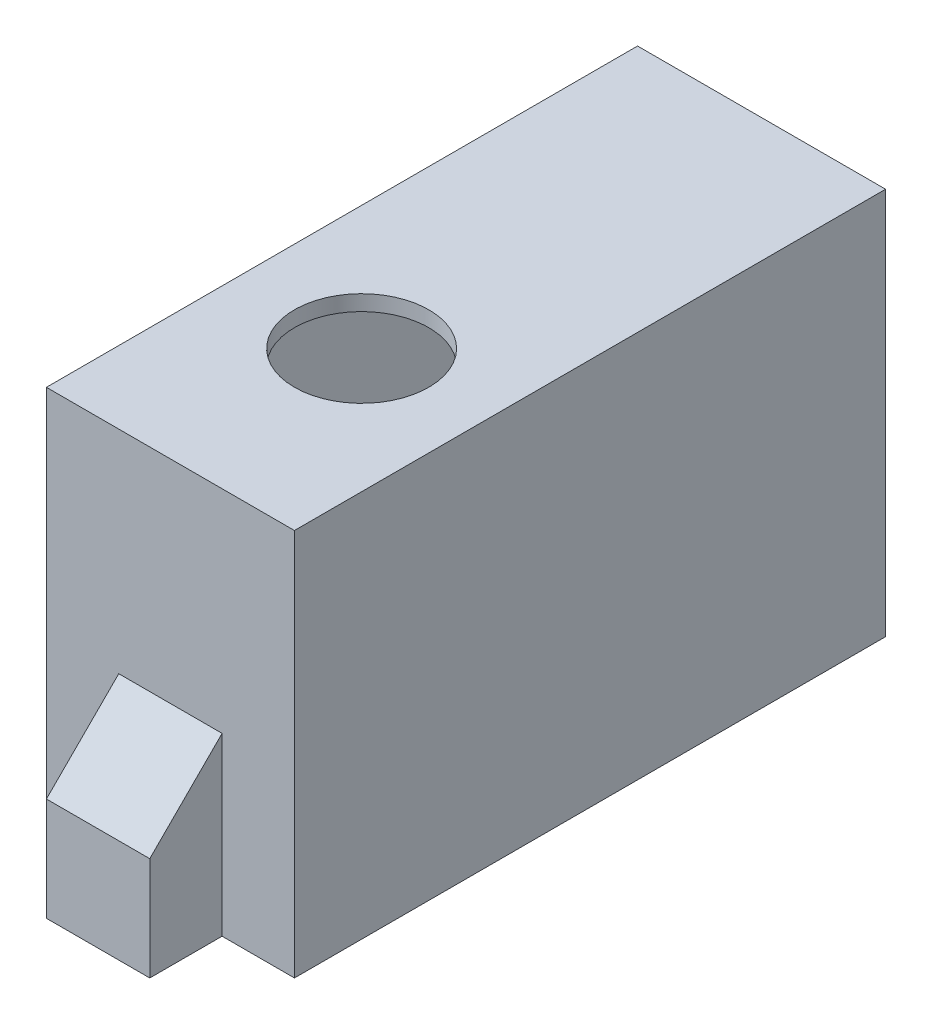
ISO-10303-21;
HEADER;
FILE_DESCRIPTION(('STEP AP214'),'2;1');
FILE_NAME('part.step','',(''),(''),'','','');
FILE_SCHEMA(('AUTOMOTIVE_DESIGN { 1 0 10303 214 1 1 1 1 }'));
ENDSEC;
DATA;
#1=APPLICATION_CONTEXT('core data for automotive mechanical design processes');
#2=APPLICATION_PROTOCOL_DEFINITION('international standard','automotive_design',2000,#1);
#3=PRODUCT_CONTEXT('',#1,'mechanical');
#4=PRODUCT('Part','Part','',(#3));
#5=PRODUCT_RELATED_PRODUCT_CATEGORY('part','',(#4));
#6=PRODUCT_DEFINITION_FORMATION('','',#4);
#7=PRODUCT_DEFINITION_CONTEXT('part definition',#1,'design');
#8=PRODUCT_DEFINITION('design','',#6,#7);
#9=PRODUCT_DEFINITION_SHAPE('','',#8);
#10=(LENGTH_UNIT() NAMED_UNIT(*) SI_UNIT(.MILLI.,.METRE.));
#11=(NAMED_UNIT(*) PLANE_ANGLE_UNIT() SI_UNIT($,.RADIAN.));
#12=(NAMED_UNIT(*) SI_UNIT($,.STERADIAN.) SOLID_ANGLE_UNIT());
#13=UNCERTAINTY_MEASURE_WITH_UNIT(LENGTH_MEASURE(1.E-05),#10,'distance_accuracy_value','');
#14=(GEOMETRIC_REPRESENTATION_CONTEXT(3) GLOBAL_UNCERTAINTY_ASSIGNED_CONTEXT((#13)) GLOBAL_UNIT_ASSIGNED_CONTEXT((#10,
#11,#12)) REPRESENTATION_CONTEXT('',''));
#15=CARTESIAN_POINT('',(0.,0.,0.));
#16=DIRECTION('',(0.,0.,1.));
#17=DIRECTION('',(1.,0.,0.));
#18=AXIS2_PLACEMENT_3D('',#15,#16,#17);
#19=CARTESIAN_POINT('',(-10.,36.,28.6));
#20=DIRECTION('',(0.,0.,-1.));
#21=DIRECTION('',(-1.,0.,0.));
#22=AXIS2_PLACEMENT_3D('',#19,#20,#21);
#23=PLANE('',#22);
#24=DIRECTION('',(1.,0.,0.));
#25=VECTOR('',#24,1.);
#26=CARTESIAN_POINT('',(-10.,37.5,28.6));
#27=LINE('',#26,#25);
#28=CARTESIAN_POINT('',(-12.,37.5,28.6));
#29=VERTEX_POINT('',#28);
#30=CARTESIAN_POINT('',(12.,37.5,28.6));
#31=VERTEX_POINT('',#30);
#32=EDGE_CURVE('E49',#29,#31,#27,.T.);
#33=ORIENTED_EDGE('',*,*,#32,.F.);
#34=DIRECTION('',(0.,-1.,0.));
#35=VECTOR('',#34,1.);
#36=CARTESIAN_POINT('',(-12.,36.,28.6));
#37=LINE('',#36,#35);
#38=CARTESIAN_POINT('',(-12.,0.,28.6));
#39=VERTEX_POINT('',#38);
#40=EDGE_CURVE('E167',#29,#39,#37,.T.);
#41=ORIENTED_EDGE('',*,*,#40,.T.);
#42=DIRECTION('',(1.,0.,0.));
#43=VECTOR('',#42,1.);
#44=CARTESIAN_POINT('',(-10.,0.,28.6));
#45=LINE('',#44,#43);
#46=CARTESIAN_POINT('',(-5.,0.,28.6));
#47=VERTEX_POINT('',#46);
#48=EDGE_CURVE('E195',#39,#47,#45,.T.);
#49=ORIENTED_EDGE('',*,*,#48,.T.);
#50=DIRECTION('',(0.,-1.,0.));
#51=VECTOR('',#50,1.);
#52=CARTESIAN_POINT('',(-5.,0.,28.6));
#53=LINE('',#52,#51);
#54=CARTESIAN_POINT('',(-5.,17.,28.6));
#55=VERTEX_POINT('',#54);
#56=EDGE_CURVE('E57',#55,#47,#53,.T.);
#57=ORIENTED_EDGE('',*,*,#56,.F.);
#58=DIRECTION('',(1.,0.,0.));
#59=VECTOR('',#58,1.);
#60=CARTESIAN_POINT('',(5.,17.,28.6));
#61=LINE('',#60,#59);
#62=CARTESIAN_POINT('',(5.,17.,28.6));
#63=VERTEX_POINT('',#62);
#64=EDGE_CURVE('E243',#55,#63,#61,.T.);
#65=ORIENTED_EDGE('',*,*,#64,.T.);
#66=DIRECTION('',(0.,1.,0.));
#67=VECTOR('',#66,1.);
#68=CARTESIAN_POINT('',(5.,0.,28.6));
#69=LINE('',#68,#67);
#70=CARTESIAN_POINT('',(5.,0.,28.6));
#71=VERTEX_POINT('',#70);
#72=EDGE_CURVE('E269',#71,#63,#69,.T.);
#73=ORIENTED_EDGE('',*,*,#72,.F.);
#74=CARTESIAN_POINT('',(12.,0.,28.6));
#75=VERTEX_POINT('',#74);
#76=EDGE_CURVE('E175',#71,#75,#45,.T.);
#77=ORIENTED_EDGE('',*,*,#76,.T.);
#78=DIRECTION('',(0.,-1.,0.));
#79=VECTOR('',#78,1.);
#80=CARTESIAN_POINT('',(12.,36.,28.6));
#81=LINE('',#80,#79);
#82=EDGE_CURVE('E165',#31,#75,#81,.T.);
#83=ORIENTED_EDGE('',*,*,#82,.F.);
#84=EDGE_LOOP('',(#33,#41,#49,#57,#65,#73,#77,#83));
#85=FACE_BOUND('',#84,.T.);
#86=ADVANCED_FACE('F33',(#85),#23,.F.);
#87=CARTESIAN_POINT('',(-10.,36.,-28.6));
#88=DIRECTION('',(0.,0.,1.));
#89=DIRECTION('',(1.,0.,0.));
#90=AXIS2_PLACEMENT_3D('',#87,#88,#89);
#91=PLANE('',#90);
#92=DIRECTION('',(-1.,0.,0.));
#93=VECTOR('',#92,1.);
#94=CARTESIAN_POINT('',(-10.,37.5,-28.6));
#95=LINE('',#94,#93);
#96=CARTESIAN_POINT('',(12.,37.5,-28.6));
#97=VERTEX_POINT('',#96);
#98=CARTESIAN_POINT('',(-12.,37.5,-28.6));
#99=VERTEX_POINT('',#98);
#100=EDGE_CURVE('E147',#97,#99,#95,.T.);
#101=ORIENTED_EDGE('',*,*,#100,.F.);
#102=DIRECTION('',(0.,-1.,0.));
#103=VECTOR('',#102,1.);
#104=CARTESIAN_POINT('',(12.,36.,-28.6));
#105=LINE('',#104,#103);
#106=CARTESIAN_POINT('',(12.,0.,-28.6));
#107=VERTEX_POINT('',#106);
#108=EDGE_CURVE('E156',#97,#107,#105,.T.);
#109=ORIENTED_EDGE('',*,*,#108,.T.);
#110=DIRECTION('',(-1.,0.,0.));
#111=VECTOR('',#110,1.);
#112=CARTESIAN_POINT('',(-10.,0.,-28.6));
#113=LINE('',#112,#111);
#114=CARTESIAN_POINT('',(4.99999999999999,0.,-28.6));
#115=VERTEX_POINT('',#114);
#116=EDGE_CURVE('E169',#107,#115,#113,.T.);
#117=ORIENTED_EDGE('',*,*,#116,.T.);
#118=DIRECTION('',(0.,-1.,0.));
#119=VECTOR('',#118,1.);
#120=CARTESIAN_POINT('',(4.99999999999999,10.,-28.6));
#121=LINE('',#120,#119);
#122=CARTESIAN_POINT('',(5.,17.,-28.6));
#123=VERTEX_POINT('',#122);
#124=EDGE_CURVE('E197',#123,#115,#121,.T.);
#125=ORIENTED_EDGE('',*,*,#124,.F.);
#126=DIRECTION('',(-1.,0.,0.));
#127=VECTOR('',#126,1.);
#128=CARTESIAN_POINT('',(-5.00000000000001,17.,-28.6));
#129=LINE('',#128,#127);
#130=CARTESIAN_POINT('',(-5.00000000000001,17.,-28.6));
#131=VERTEX_POINT('',#130);
#132=EDGE_CURVE('E239',#123,#131,#129,.T.);
#133=ORIENTED_EDGE('',*,*,#132,.T.);
#134=DIRECTION('',(0.,1.,0.));
#135=VECTOR('',#134,1.);
#136=CARTESIAN_POINT('',(-5.00000000000001,10.,-28.6));
#137=LINE('',#136,#135);
#138=CARTESIAN_POINT('',(-5.00000000000001,0.,-28.6));
#139=VERTEX_POINT('',#138);
#140=EDGE_CURVE('E201',#139,#131,#137,.T.);
#141=ORIENTED_EDGE('',*,*,#140,.F.);
#142=CARTESIAN_POINT('',(-12.,0.,-28.6));
#143=VERTEX_POINT('',#142);
#144=EDGE_CURVE('E182',#139,#143,#113,.T.);
#145=ORIENTED_EDGE('',*,*,#144,.T.);
#146=DIRECTION('',(0.,-1.,0.));
#147=VECTOR('',#146,1.);
#148=CARTESIAN_POINT('',(-12.,36.,-28.6));
#149=LINE('',#148,#147);
#150=EDGE_CURVE('E159',#99,#143,#149,.T.);
#151=ORIENTED_EDGE('',*,*,#150,.F.);
#152=EDGE_LOOP('',(#101,#109,#117,#125,#133,#141,#145,#151));
#153=FACE_BOUND('',#152,.T.);
#154=ADVANCED_FACE('F155',(#153),#91,.F.);
#155=CARTESIAN_POINT('',(-12.,36.,-26.6));
#156=DIRECTION('',(1.,0.,0.));
#157=DIRECTION('',(0.,0.,-1.));
#158=AXIS2_PLACEMENT_3D('',#155,#156,#157);
#159=PLANE('',#158);
#160=DIRECTION('',(0.,0.,1.));
#161=VECTOR('',#160,1.);
#162=CARTESIAN_POINT('',(-12.,37.5,-26.6));
#163=LINE('',#162,#161);
#164=EDGE_CURVE('E323',#99,#29,#163,.T.);
#165=ORIENTED_EDGE('',*,*,#164,.F.);
#166=ORIENTED_EDGE('',*,*,#150,.T.);
#167=DIRECTION('',(0.,0.,1.));
#168=VECTOR('',#167,1.);
#169=CARTESIAN_POINT('',(-12.,0.,-26.6));
#170=LINE('',#169,#168);
#171=EDGE_CURVE('E172',#143,#39,#170,.T.);
#172=ORIENTED_EDGE('',*,*,#171,.T.);
#173=ORIENTED_EDGE('',*,*,#40,.F.);
#174=EDGE_LOOP('',(#165,#166,#172,#173));
#175=FACE_BOUND('',#174,.T.);
#176=ADVANCED_FACE('F322',(#175),#159,.F.);
#177=CARTESIAN_POINT('',(12.,36.,-26.6));
#178=DIRECTION('',(-1.,0.,0.));
#179=DIRECTION('',(0.,0.,1.));
#180=AXIS2_PLACEMENT_3D('',#177,#178,#179);
#181=PLANE('',#180);
#182=DIRECTION('',(0.,0.,-1.));
#183=VECTOR('',#182,1.);
#184=CARTESIAN_POINT('',(12.,37.5,-26.6));
#185=LINE('',#184,#183);
#186=EDGE_CURVE('E144',#31,#97,#185,.T.);
#187=ORIENTED_EDGE('',*,*,#186,.F.);
#188=ORIENTED_EDGE('',*,*,#82,.T.);
#189=DIRECTION('',(0.,0.,-1.));
#190=VECTOR('',#189,1.);
#191=CARTESIAN_POINT('',(12.,0.,-26.6));
#192=LINE('',#191,#190);
#193=EDGE_CURVE('E163',#75,#107,#192,.T.);
#194=ORIENTED_EDGE('',*,*,#193,.T.);
#195=ORIENTED_EDGE('',*,*,#108,.F.);
#196=EDGE_LOOP('',(#187,#188,#194,#195));
#197=FACE_BOUND('',#196,.T.);
#198=ADVANCED_FACE('F161',(#197),#181,.F.);
#199=CARTESIAN_POINT('',(0.,33.,10.1));
#200=DIRECTION('',(0.,1.,0.));
#201=DIRECTION('',(0.,0.,1.));
#202=AXIS2_PLACEMENT_3D('',#199,#200,#201);
#203=CYLINDRICAL_SURFACE('',#202,6.5);
#204=CARTESIAN_POINT('',(0.,36.,10.1));
#205=DIRECTION('',(0.,1.,0.));
#206=DIRECTION('',(0.,0.,1.));
#207=AXIS2_PLACEMENT_3D('',#204,#205,#206);
#208=CIRCLE('',#207,6.5);
#209=CARTESIAN_POINT('',(0.,36.,16.6));
#210=VERTEX_POINT('',#209);
#211=EDGE_CURVE('E186',#210,#210,#208,.T.);
#212=ORIENTED_EDGE('',*,*,#211,.F.);
#213=EDGE_LOOP('',(#212));
#214=FACE_BOUND('',#213,.T.);
#215=CARTESIAN_POINT('',(0.,37.5,10.1));
#216=DIRECTION('',(0.,1.,0.));
#217=DIRECTION('',(0.,0.,1.));
#218=AXIS2_PLACEMENT_3D('',#215,#216,#217);
#219=CIRCLE('',#218,6.5);
#220=CARTESIAN_POINT('',(0.,37.5,16.6));
#221=VERTEX_POINT('',#220);
#222=EDGE_CURVE('E37',#221,#221,#219,.F.);
#223=ORIENTED_EDGE('',*,*,#222,.F.);
#224=EDGE_LOOP('',(#223));
#225=FACE_BOUND('',#224,.T.);
#226=ADVANCED_FACE('F363',(#214,#225),#203,.F.);
#227=CARTESIAN_POINT('',(0.,0.,0.));
#228=DIRECTION('',(0.,1.,0.));
#229=DIRECTION('',(0.,0.,1.));
#230=AXIS2_PLACEMENT_3D('',#227,#228,#229);
#231=PLANE('',#230);
#232=CARTESIAN_POINT('',(0.,0.,-31.6));
#233=DIRECTION('',(0.,-1.,0.));
#234=DIRECTION('',(0.,0.,-1.));
#235=AXIS2_PLACEMENT_3D('',#232,#233,#234);
#236=CIRCLE('',#235,1.75);
#237=CARTESIAN_POINT('',(0.,0.,-33.35));
#238=VERTEX_POINT('',#237);
#239=EDGE_CURVE('E324',#238,#238,#236,.T.);
#240=ORIENTED_EDGE('',*,*,#239,.F.);
#241=EDGE_LOOP('',(#240));
#242=FACE_BOUND('',#241,.T.);
#243=CARTESIAN_POINT('',(0.,0.,31.6));
#244=DIRECTION('',(0.,-1.,0.));
#245=DIRECTION('',(0.,0.,-1.));
#246=AXIS2_PLACEMENT_3D('',#243,#244,#245);
#247=CIRCLE('',#246,1.75);
#248=CARTESIAN_POINT('',(0.,0.,29.85));
#249=VERTEX_POINT('',#248);
#250=EDGE_CURVE('E332',#249,#249,#247,.T.);
#251=ORIENTED_EDGE('',*,*,#250,.F.);
#252=EDGE_LOOP('',(#251));
#253=FACE_BOUND('',#252,.T.);
#254=DIRECTION('',(-1.,0.,0.));
#255=VECTOR('',#254,1.);
#256=CARTESIAN_POINT('',(-10.,0.,-26.6));
#257=LINE('',#256,#255);
#258=CARTESIAN_POINT('',(9.99999999999999,0.,-26.6));
#259=VERTEX_POINT('',#258);
#260=CARTESIAN_POINT('',(-10.,0.,-26.6));
#261=VERTEX_POINT('',#260);
#262=EDGE_CURVE('E214',#259,#261,#257,.T.);
#263=ORIENTED_EDGE('',*,*,#262,.T.);
#264=DIRECTION('',(0.,0.,1.));
#265=VECTOR('',#264,1.);
#266=CARTESIAN_POINT('',(-10.,0.,-26.6));
#267=LINE('',#266,#265);
#268=CARTESIAN_POINT('',(-10.,0.,26.6));
#269=VERTEX_POINT('',#268);
#270=EDGE_CURVE('E188',#261,#269,#267,.T.);
#271=ORIENTED_EDGE('',*,*,#270,.T.);
#272=DIRECTION('',(1.,0.,0.));
#273=VECTOR('',#272,1.);
#274=CARTESIAN_POINT('',(-10.,0.,26.6));
#275=LINE('',#274,#273);
#276=CARTESIAN_POINT('',(10.,0.,26.6));
#277=VERTEX_POINT('',#276);
#278=EDGE_CURVE('E223',#269,#277,#275,.T.);
#279=ORIENTED_EDGE('',*,*,#278,.T.);
#280=DIRECTION('',(0.,0.,-1.));
#281=VECTOR('',#280,1.);
#282=CARTESIAN_POINT('',(9.99999999999999,0.,-26.6));
#283=LINE('',#282,#281);
#284=EDGE_CURVE('E226',#277,#259,#283,.T.);
#285=ORIENTED_EDGE('',*,*,#284,.T.);
#286=EDGE_LOOP('',(#263,#271,#279,#285));
#287=FACE_BOUND('',#286,.T.);
#288=ORIENTED_EDGE('',*,*,#171,.F.);
#289=ORIENTED_EDGE('',*,*,#144,.F.);
#290=DIRECTION('',(0.,0.,1.));
#291=VECTOR('',#290,1.);
#292=CARTESIAN_POINT('',(-5.00000000000001,0.,-35.6));
#293=LINE('',#292,#291);
#294=CARTESIAN_POINT('',(-5.00000000000001,0.,-35.6));
#295=VERTEX_POINT('',#294);
#296=EDGE_CURVE('E308',#295,#139,#293,.T.);
#297=ORIENTED_EDGE('',*,*,#296,.F.);
#298=DIRECTION('',(-1.,0.,0.));
#299=VECTOR('',#298,1.);
#300=CARTESIAN_POINT('',(4.99999999999999,0.,-35.6));
#301=LINE('',#300,#299);
#302=CARTESIAN_POINT('',(4.99999999999999,0.,-35.6));
#303=VERTEX_POINT('',#302);
#304=EDGE_CURVE('E301',#303,#295,#301,.T.);
#305=ORIENTED_EDGE('',*,*,#304,.F.);
#306=DIRECTION('',(0.,0.,1.));
#307=VECTOR('',#306,1.);
#308=CARTESIAN_POINT('',(4.99999999999999,0.,-35.6));
#309=LINE('',#308,#307);
#310=EDGE_CURVE('E189',#303,#115,#309,.T.);
#311=ORIENTED_EDGE('',*,*,#310,.T.);
#312=ORIENTED_EDGE('',*,*,#116,.F.);
#313=ORIENTED_EDGE('',*,*,#193,.F.);
#314=ORIENTED_EDGE('',*,*,#76,.F.);
#315=DIRECTION('',(0.,0.,-1.));
#316=VECTOR('',#315,1.);
#317=CARTESIAN_POINT('',(5.,0.,35.6));
#318=LINE('',#317,#316);
#319=CARTESIAN_POINT('',(5.,0.,35.6));
#320=VERTEX_POINT('',#319);
#321=EDGE_CURVE('E277',#320,#71,#318,.T.);
#322=ORIENTED_EDGE('',*,*,#321,.F.);
#323=DIRECTION('',(1.,0.,0.));
#324=VECTOR('',#323,1.);
#325=CARTESIAN_POINT('',(-5.,0.,35.6));
#326=LINE('',#325,#324);
#327=CARTESIAN_POINT('',(-5.,0.,35.6));
#328=VERTEX_POINT('',#327);
#329=EDGE_CURVE('E293',#328,#320,#326,.T.);
#330=ORIENTED_EDGE('',*,*,#329,.F.);
#331=DIRECTION('',(0.,0.,-1.));
#332=VECTOR('',#331,1.);
#333=CARTESIAN_POINT('',(-5.,0.,35.6));
#334=LINE('',#333,#332);
#335=EDGE_CURVE('E202',#328,#47,#334,.T.);
#336=ORIENTED_EDGE('',*,*,#335,.T.);
#337=ORIENTED_EDGE('',*,*,#48,.F.);
#338=EDGE_LOOP('',(#288,#289,#297,#305,#311,#312,#313,#314,#322,#330,#336,#337));
#339=FACE_BOUND('',#338,.T.);
#340=ADVANCED_FACE('F276',(#242,#253,#287,#339),#231,.F.);
#341=CARTESIAN_POINT('',(-10.,36.,-26.6));
#342=DIRECTION('',(1.,0.,0.));
#343=DIRECTION('',(0.,0.,-1.));
#344=AXIS2_PLACEMENT_3D('',#341,#342,#343);
#345=PLANE('',#344);
#346=ORIENTED_EDGE('',*,*,#270,.F.);
#347=DIRECTION('',(0.,-1.,0.));
#348=VECTOR('',#347,1.);
#349=CARTESIAN_POINT('',(-10.,36.,-26.6));
#350=LINE('',#349,#348);
#351=CARTESIAN_POINT('',(-10.,36.,-26.6));
#352=VERTEX_POINT('',#351);
#353=EDGE_CURVE('E220',#352,#261,#350,.T.);
#354=ORIENTED_EDGE('',*,*,#353,.F.);
#355=DIRECTION('',(0.,0.,1.));
#356=VECTOR('',#355,1.);
#357=CARTESIAN_POINT('',(-10.,36.,-26.6));
#358=LINE('',#357,#356);
#359=CARTESIAN_POINT('',(-10.,36.,26.6));
#360=VERTEX_POINT('',#359);
#361=EDGE_CURVE('E210',#352,#360,#358,.T.);
#362=ORIENTED_EDGE('',*,*,#361,.T.);
#363=DIRECTION('',(0.,-1.,0.));
#364=VECTOR('',#363,1.);
#365=CARTESIAN_POINT('',(-10.,36.,26.6));
#366=LINE('',#365,#364);
#367=EDGE_CURVE('E176',#360,#269,#366,.T.);
#368=ORIENTED_EDGE('',*,*,#367,.T.);
#369=EDGE_LOOP('',(#346,#354,#362,#368));
#370=FACE_BOUND('',#369,.T.);
#371=ADVANCED_FACE('F407',(#370),#345,.T.);
#372=CARTESIAN_POINT('',(-10.,36.,26.6));
#373=DIRECTION('',(0.,0.,-1.));
#374=DIRECTION('',(-1.,0.,0.));
#375=AXIS2_PLACEMENT_3D('',#372,#373,#374);
#376=PLANE('',#375);
#377=ORIENTED_EDGE('',*,*,#278,.F.);
#378=ORIENTED_EDGE('',*,*,#367,.F.);
#379=DIRECTION('',(1.,0.,0.));
#380=VECTOR('',#379,1.);
#381=CARTESIAN_POINT('',(-10.,36.,26.6));
#382=LINE('',#381,#380);
#383=CARTESIAN_POINT('',(10.,36.,26.6));
#384=VERTEX_POINT('',#383);
#385=EDGE_CURVE('E213',#360,#384,#382,.T.);
#386=ORIENTED_EDGE('',*,*,#385,.T.);
#387=DIRECTION('',(0.,-1.,0.));
#388=VECTOR('',#387,1.);
#389=CARTESIAN_POINT('',(10.,36.,26.6));
#390=LINE('',#389,#388);
#391=EDGE_CURVE('E234',#384,#277,#390,.T.);
#392=ORIENTED_EDGE('',*,*,#391,.T.);
#393=EDGE_LOOP('',(#377,#378,#386,#392));
#394=FACE_BOUND('',#393,.T.);
#395=ADVANCED_FACE('F403',(#394),#376,.T.);
#396=CARTESIAN_POINT('',(9.99999999999999,36.,-26.6));
#397=DIRECTION('',(-1.,0.,0.));
#398=DIRECTION('',(0.,0.,1.));
#399=AXIS2_PLACEMENT_3D('',#396,#397,#398);
#400=PLANE('',#399);
#401=ORIENTED_EDGE('',*,*,#284,.F.);
#402=ORIENTED_EDGE('',*,*,#391,.F.);
#403=DIRECTION('',(0.,0.,-1.));
#404=VECTOR('',#403,1.);
#405=CARTESIAN_POINT('',(9.99999999999999,36.,-26.6));
#406=LINE('',#405,#404);
#407=CARTESIAN_POINT('',(9.99999999999999,36.,-26.6));
#408=VERTEX_POINT('',#407);
#409=EDGE_CURVE('E216',#384,#408,#406,.T.);
#410=ORIENTED_EDGE('',*,*,#409,.T.);
#411=DIRECTION('',(0.,-1.,0.));
#412=VECTOR('',#411,1.);
#413=CARTESIAN_POINT('',(9.99999999999999,36.,-26.6));
#414=LINE('',#413,#412);
#415=EDGE_CURVE('E232',#408,#259,#414,.T.);
#416=ORIENTED_EDGE('',*,*,#415,.T.);
#417=EDGE_LOOP('',(#401,#402,#410,#416));
#418=FACE_BOUND('',#417,.T.);
#419=ADVANCED_FACE('F399',(#418),#400,.T.);
#420=CARTESIAN_POINT('',(-10.,36.,-26.6));
#421=DIRECTION('',(0.,0.,1.));
#422=DIRECTION('',(1.,0.,0.));
#423=AXIS2_PLACEMENT_3D('',#420,#421,#422);
#424=PLANE('',#423);
#425=ORIENTED_EDGE('',*,*,#262,.F.);
#426=ORIENTED_EDGE('',*,*,#415,.F.);
#427=DIRECTION('',(-1.,0.,0.));
#428=VECTOR('',#427,1.);
#429=CARTESIAN_POINT('',(-10.,36.,-26.6));
#430=LINE('',#429,#428);
#431=EDGE_CURVE('E218',#408,#352,#430,.T.);
#432=ORIENTED_EDGE('',*,*,#431,.T.);
#433=ORIENTED_EDGE('',*,*,#353,.T.);
#434=EDGE_LOOP('',(#425,#426,#432,#433));
#435=FACE_BOUND('',#434,.T.);
#436=ADVANCED_FACE('F395',(#435),#424,.T.);
#437=CARTESIAN_POINT('',(0.,36.,0.));
#438=DIRECTION('',(0.,1.,0.));
#439=DIRECTION('',(0.,0.,1.));
#440=AXIS2_PLACEMENT_3D('',#437,#438,#439);
#441=PLANE('',#440);
#442=ORIENTED_EDGE('',*,*,#211,.T.);
#443=EDGE_LOOP('',(#442));
#444=FACE_BOUND('',#443,.T.);
#445=ORIENTED_EDGE('',*,*,#361,.F.);
#446=ORIENTED_EDGE('',*,*,#431,.F.);
#447=ORIENTED_EDGE('',*,*,#409,.F.);
#448=ORIENTED_EDGE('',*,*,#385,.F.);
#449=EDGE_LOOP('',(#445,#446,#447,#448));
#450=FACE_BOUND('',#449,.T.);
#451=ADVANCED_FACE('F389',(#444,#450),#441,.F.);
#452=CARTESIAN_POINT('',(4.99999999999999,10.,-35.6));
#453=DIRECTION('',(-1.,0.,0.));
#454=DIRECTION('',(0.,0.,1.));
#455=AXIS2_PLACEMENT_3D('',#452,#453,#454);
#456=PLANE('',#455);
#457=ORIENTED_EDGE('',*,*,#124,.T.);
#458=ORIENTED_EDGE('',*,*,#310,.F.);
#459=DIRECTION('',(0.,-1.,0.));
#460=VECTOR('',#459,1.);
#461=CARTESIAN_POINT('',(4.99999999999999,10.,-35.6));
#462=LINE('',#461,#460);
#463=CARTESIAN_POINT('',(4.99999999999999,10.,-35.6));
#464=VERTEX_POINT('',#463);
#465=EDGE_CURVE('E298',#464,#303,#462,.T.);
#466=ORIENTED_EDGE('',*,*,#465,.F.);
#467=DIRECTION('',(0.,-0.707106781186544,-0.707106781186551));
#468=VECTOR('',#467,1.);
#469=CARTESIAN_POINT('',(4.99999999999999,10.,-35.6));
#470=LINE('',#469,#468);
#471=EDGE_CURVE('E247',#464,#123,#470,.F.);
#472=ORIENTED_EDGE('',*,*,#471,.T.);
#473=EDGE_LOOP('',(#457,#458,#466,#472));
#474=FACE_BOUND('',#473,.T.);
#475=ADVANCED_FACE('F375',(#474),#456,.F.);
#476=CARTESIAN_POINT('',(-5.00000000000001,10.,-35.6));
#477=DIRECTION('',(1.,0.,0.));
#478=DIRECTION('',(0.,0.,-1.));
#479=AXIS2_PLACEMENT_3D('',#476,#477,#478);
#480=PLANE('',#479);
#481=ORIENTED_EDGE('',*,*,#140,.T.);
#482=DIRECTION('',(0.,0.707106781186544,0.707106781186551));
#483=VECTOR('',#482,1.);
#484=CARTESIAN_POINT('',(-5.00000000000001,10.,-35.6));
#485=LINE('',#484,#483);
#486=CARTESIAN_POINT('',(-5.00000000000001,10.,-35.6));
#487=VERTEX_POINT('',#486);
#488=EDGE_CURVE('E255',#131,#487,#485,.F.);
#489=ORIENTED_EDGE('',*,*,#488,.T.);
#490=DIRECTION('',(0.,1.,0.));
#491=VECTOR('',#490,1.);
#492=CARTESIAN_POINT('',(-5.00000000000001,10.,-35.6));
#493=LINE('',#492,#491);
#494=EDGE_CURVE('E302',#295,#487,#493,.T.);
#495=ORIENTED_EDGE('',*,*,#494,.F.);
#496=ORIENTED_EDGE('',*,*,#296,.T.);
#497=EDGE_LOOP('',(#481,#489,#495,#496));
#498=FACE_BOUND('',#497,.T.);
#499=ADVANCED_FACE('F319',(#498),#480,.F.);
#500=CARTESIAN_POINT('',(0.,0.,-35.6));
#501=DIRECTION('',(0.,0.,-1.));
#502=DIRECTION('',(-1.,0.,0.));
#503=AXIS2_PLACEMENT_3D('',#500,#501,#502);
#504=PLANE('',#503);
#505=ORIENTED_EDGE('',*,*,#465,.T.);
#506=ORIENTED_EDGE('',*,*,#304,.T.);
#507=ORIENTED_EDGE('',*,*,#494,.T.);
#508=DIRECTION('',(1.,0.,0.));
#509=VECTOR('',#508,1.);
#510=CARTESIAN_POINT('',(4.99999999999999,10.,-35.6));
#511=LINE('',#510,#509);
#512=EDGE_CURVE('E208',#487,#464,#511,.T.);
#513=ORIENTED_EDGE('',*,*,#512,.T.);
#514=EDGE_LOOP('',(#505,#506,#507,#513));
#515=FACE_BOUND('',#514,.T.);
#516=ADVANCED_FACE('F377',(#515),#504,.T.);
#517=CARTESIAN_POINT('',(-5.,0.,35.6));
#518=DIRECTION('',(1.,0.,0.));
#519=DIRECTION('',(0.,0.,-1.));
#520=AXIS2_PLACEMENT_3D('',#517,#518,#519);
#521=PLANE('',#520);
#522=ORIENTED_EDGE('',*,*,#56,.T.);
#523=ORIENTED_EDGE('',*,*,#335,.F.);
#524=DIRECTION('',(0.,-1.,0.));
#525=VECTOR('',#524,1.);
#526=CARTESIAN_POINT('',(-5.,0.,35.6));
#527=LINE('',#526,#525);
#528=CARTESIAN_POINT('',(-5.,10.,35.6));
#529=VERTEX_POINT('',#528);
#530=EDGE_CURVE('E263',#529,#328,#527,.T.);
#531=ORIENTED_EDGE('',*,*,#530,.F.);
#532=DIRECTION('',(0.,-0.707106781186544,0.707106781186551));
#533=VECTOR('',#532,1.);
#534=CARTESIAN_POINT('',(-5.,5.00000000000008,40.6));
#535=LINE('',#534,#533);
#536=EDGE_CURVE('E42',#529,#55,#535,.F.);
#537=ORIENTED_EDGE('',*,*,#536,.T.);
#538=EDGE_LOOP('',(#522,#523,#531,#537));
#539=FACE_BOUND('',#538,.T.);
#540=ADVANCED_FACE('F260',(#539),#521,.F.);
#541=CARTESIAN_POINT('',(5.,0.,35.6));
#542=DIRECTION('',(-1.,0.,0.));
#543=DIRECTION('',(0.,0.,1.));
#544=AXIS2_PLACEMENT_3D('',#541,#542,#543);
#545=PLANE('',#544);
#546=ORIENTED_EDGE('',*,*,#72,.T.);
#547=DIRECTION('',(0.,0.707106781186544,-0.707106781186551));
#548=VECTOR('',#547,1.);
#549=CARTESIAN_POINT('',(5.,5.00000000000008,40.6));
#550=LINE('',#549,#548);
#551=CARTESIAN_POINT('',(5.,10.,35.6));
#552=VERTEX_POINT('',#551);
#553=EDGE_CURVE('E11',#63,#552,#550,.F.);
#554=ORIENTED_EDGE('',*,*,#553,.T.);
#555=DIRECTION('',(0.,1.,0.));
#556=VECTOR('',#555,1.);
#557=CARTESIAN_POINT('',(5.,0.,35.6));
#558=LINE('',#557,#556);
#559=EDGE_CURVE('E281',#320,#552,#558,.T.);
#560=ORIENTED_EDGE('',*,*,#559,.F.);
#561=ORIENTED_EDGE('',*,*,#321,.T.);
#562=EDGE_LOOP('',(#546,#554,#560,#561));
#563=FACE_BOUND('',#562,.T.);
#564=ADVANCED_FACE('F279',(#563),#545,.F.);
#565=CARTESIAN_POINT('',(0.,0.,35.6));
#566=DIRECTION('',(0.,0.,-1.));
#567=DIRECTION('',(-1.,0.,0.));
#568=AXIS2_PLACEMENT_3D('',#565,#566,#567);
#569=PLANE('',#568);
#570=ORIENTED_EDGE('',*,*,#530,.T.);
#571=ORIENTED_EDGE('',*,*,#329,.T.);
#572=ORIENTED_EDGE('',*,*,#559,.T.);
#573=DIRECTION('',(-1.,0.,0.));
#574=VECTOR('',#573,1.);
#575=CARTESIAN_POINT('',(-5.,10.,35.6));
#576=LINE('',#575,#574);
#577=EDGE_CURVE('E282',#552,#529,#576,.T.);
#578=ORIENTED_EDGE('',*,*,#577,.T.);
#579=EDGE_LOOP('',(#570,#571,#572,#578));
#580=FACE_BOUND('',#579,.T.);
#581=ADVANCED_FACE('F339',(#580),#569,.F.);
#582=CARTESIAN_POINT('',(0.,7.,31.6));
#583=DIRECTION('',(0.,-1.,0.));
#584=DIRECTION('',(0.,0.,-1.));
#585=AXIS2_PLACEMENT_3D('',#582,#583,#584);
#586=CYLINDRICAL_SURFACE('',#585,1.75);
#587=CARTESIAN_POINT('',(0.,7.,31.6));
#588=DIRECTION('',(0.,-1.,0.));
#589=DIRECTION('',(0.,0.,-1.));
#590=AXIS2_PLACEMENT_3D('',#587,#588,#589);
#591=CIRCLE('',#590,1.75);
#592=CARTESIAN_POINT('',(0.,7.,29.85));
#593=VERTEX_POINT('',#592);
#594=EDGE_CURVE('E334',#593,#593,#591,.T.);
#595=ORIENTED_EDGE('',*,*,#594,.F.);
#596=EDGE_LOOP('',(#595));
#597=FACE_BOUND('',#596,.T.);
#598=ORIENTED_EDGE('',*,*,#250,.T.);
#599=EDGE_LOOP('',(#598));
#600=FACE_BOUND('',#599,.T.);
#601=ADVANCED_FACE('F341',(#597,#600),#586,.F.);
#602=CARTESIAN_POINT('',(0.,7.,31.6));
#603=DIRECTION('',(0.,-1.,0.));
#604=DIRECTION('',(0.,0.,-1.));
#605=AXIS2_PLACEMENT_3D('',#602,#603,#604);
#606=PLANE('',#605);
#607=ORIENTED_EDGE('',*,*,#594,.T.);
#608=EDGE_LOOP('',(#607));
#609=FACE_BOUND('',#608,.T.);
#610=ADVANCED_FACE('F348',(#609),#606,.T.);
#611=CARTESIAN_POINT('',(0.,7.,-31.6));
#612=DIRECTION('',(0.,-1.,0.));
#613=DIRECTION('',(0.,0.,-1.));
#614=AXIS2_PLACEMENT_3D('',#611,#612,#613);
#615=CYLINDRICAL_SURFACE('',#614,1.75);
#616=CARTESIAN_POINT('',(0.,7.,-31.6));
#617=DIRECTION('',(0.,-1.,0.));
#618=DIRECTION('',(0.,0.,-1.));
#619=AXIS2_PLACEMENT_3D('',#616,#617,#618);
#620=CIRCLE('',#619,1.75);
#621=CARTESIAN_POINT('',(0.,7.,-33.35));
#622=VERTEX_POINT('',#621);
#623=EDGE_CURVE('E327',#622,#622,#620,.T.);
#624=ORIENTED_EDGE('',*,*,#623,.F.);
#625=EDGE_LOOP('',(#624));
#626=FACE_BOUND('',#625,.T.);
#627=ORIENTED_EDGE('',*,*,#239,.T.);
#628=EDGE_LOOP('',(#627));
#629=FACE_BOUND('',#628,.T.);
#630=ADVANCED_FACE('F371',(#626,#629),#615,.F.);
#631=CARTESIAN_POINT('',(0.,7.,-31.6));
#632=DIRECTION('',(0.,-1.,0.));
#633=DIRECTION('',(0.,0.,-1.));
#634=AXIS2_PLACEMENT_3D('',#631,#632,#633);
#635=PLANE('',#634);
#636=ORIENTED_EDGE('',*,*,#623,.T.);
#637=EDGE_LOOP('',(#636));
#638=FACE_BOUND('',#637,.T.);
#639=ADVANCED_FACE('F366',(#638),#635,.T.);
#640=CARTESIAN_POINT('',(4.99999999999999,10.,-35.6000000000001));
#641=DIRECTION('',(0.,0.707106781186551,-0.707106781186544));
#642=DIRECTION('',(-1.,0.,0.));
#643=AXIS2_PLACEMENT_3D('',#640,#641,#642);
#644=PLANE('',#643);
#645=ORIENTED_EDGE('',*,*,#488,.F.);
#646=ORIENTED_EDGE('',*,*,#132,.F.);
#647=ORIENTED_EDGE('',*,*,#471,.F.);
#648=ORIENTED_EDGE('',*,*,#512,.F.);
#649=EDGE_LOOP('',(#645,#646,#647,#648));
#650=FACE_BOUND('',#649,.T.);
#651=ADVANCED_FACE('F364',(#650),#644,.T.);
#652=CARTESIAN_POINT('',(-5.,10.,35.6000000000001));
#653=DIRECTION('',(0.,0.707106781186551,0.707106781186544));
#654=DIRECTION('',(1.,0.,0.));
#655=AXIS2_PLACEMENT_3D('',#652,#653,#654);
#656=PLANE('',#655);
#657=ORIENTED_EDGE('',*,*,#553,.F.);
#658=ORIENTED_EDGE('',*,*,#64,.F.);
#659=ORIENTED_EDGE('',*,*,#536,.F.);
#660=ORIENTED_EDGE('',*,*,#577,.F.);
#661=EDGE_LOOP('',(#657,#658,#659,#660));
#662=FACE_BOUND('',#661,.T.);
#663=ADVANCED_FACE('F35',(#662),#656,.T.);
#664=CARTESIAN_POINT('',(0.,37.5,0.));
#665=DIRECTION('',(0.,1.,0.));
#666=DIRECTION('',(0.,0.,1.));
#667=AXIS2_PLACEMENT_3D('',#664,#665,#666);
#668=PLANE('',#667);
#669=ORIENTED_EDGE('',*,*,#222,.T.);
#670=EDGE_LOOP('',(#669));
#671=FACE_BOUND('',#670,.T.);
#672=ORIENTED_EDGE('',*,*,#164,.T.);
#673=ORIENTED_EDGE('',*,*,#32,.T.);
#674=ORIENTED_EDGE('',*,*,#186,.T.);
#675=ORIENTED_EDGE('',*,*,#100,.T.);
#676=EDGE_LOOP('',(#672,#673,#674,#675));
#677=FACE_BOUND('',#676,.T.);
#678=ADVANCED_FACE('F146',(#671,#677),#668,.T.);
#679=CLOSED_SHELL('',(#86,#154,#176,#198,#226,#340,#371,#395,#419,#436,#451,#475,#499,#516,#540,
#564,#581,#601,#610,#630,#639,#651,#663,#678));
#680=MANIFOLD_SOLID_BREP('B2',#679);
#681=ADVANCED_BREP_SHAPE_REPRESENTATION('',(#18,#680),#14);
#682=SHAPE_DEFINITION_REPRESENTATION(#9,#681);
ENDSEC;
END-ISO-10303-21;
